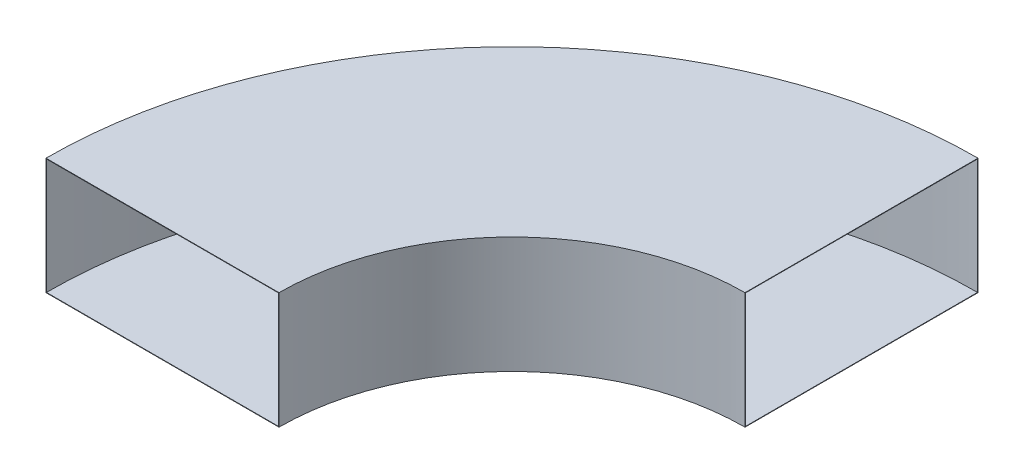
ISO-10303-21;
HEADER;
FILE_DESCRIPTION(('STEP AP214'),'2;1');
FILE_NAME('part.step','',(''),(''),'','','');
FILE_SCHEMA(('AUTOMOTIVE_DESIGN { 1 0 10303 214 1 1 1 1 }'));
ENDSEC;
DATA;
#1=APPLICATION_CONTEXT('core data for automotive mechanical design processes');
#2=APPLICATION_PROTOCOL_DEFINITION('international standard','automotive_design',2000,#1);
#3=PRODUCT_CONTEXT('',#1,'mechanical');
#4=PRODUCT('Part','Part','',(#3));
#5=PRODUCT_RELATED_PRODUCT_CATEGORY('part','',(#4));
#6=PRODUCT_DEFINITION_FORMATION('','',#4);
#7=PRODUCT_DEFINITION_CONTEXT('part definition',#1,'design');
#8=PRODUCT_DEFINITION('design','',#6,#7);
#9=PRODUCT_DEFINITION_SHAPE('','',#8);
#10=(LENGTH_UNIT() NAMED_UNIT(*) SI_UNIT(.MILLI.,.METRE.));
#11=(NAMED_UNIT(*) PLANE_ANGLE_UNIT() SI_UNIT($,.RADIAN.));
#12=(NAMED_UNIT(*) SI_UNIT($,.STERADIAN.) SOLID_ANGLE_UNIT());
#13=UNCERTAINTY_MEASURE_WITH_UNIT(LENGTH_MEASURE(1.E-05),#10,'distance_accuracy_value','');
#14=(GEOMETRIC_REPRESENTATION_CONTEXT(3) GLOBAL_UNCERTAINTY_ASSIGNED_CONTEXT((#13)) GLOBAL_UNIT_ASSIGNED_CONTEXT((#10,
#11,#12)) REPRESENTATION_CONTEXT('',''));
#15=CARTESIAN_POINT('',(0.,0.,0.));
#16=DIRECTION('',(0.,0.,1.));
#17=DIRECTION('',(1.,0.,0.));
#18=AXIS2_PLACEMENT_3D('',#15,#16,#17);
#19=CARTESIAN_POINT('',(0.,0.,0.));
#20=DIRECTION('',(0.,-1.,0.));
#21=DIRECTION('',(0.,0.,-1.));
#22=AXIS2_PLACEMENT_3D('',#19,#20,#21);
#23=CYLINDRICAL_SURFACE('',#22,1000.);
#24=CARTESIAN_POINT('',(0.,-250.000000000004,0.));
#25=DIRECTION('',(0.,-1.,0.));
#26=DIRECTION('',(0.,0.,-1.));
#27=AXIS2_PLACEMENT_3D('',#24,#25,#26);
#28=CIRCLE('',#27,1000.);
#29=CARTESIAN_POINT('',(-1000.,-250.000000000004,3.49148133884314E-12));
#30=VERTEX_POINT('',#29);
#31=CARTESIAN_POINT('',(0.,-250.000000000004,-1000.));
#32=VERTEX_POINT('',#31);
#33=EDGE_CURVE('E11',#30,#32,#28,.T.);
#34=ORIENTED_EDGE('',*,*,#33,.T.);
#35=DIRECTION('',(0.,-1.,0.));
#36=VECTOR('',#35,1.);
#37=CARTESIAN_POINT('',(0.,249.999999999996,-999.999999999998));
#38=LINE('',#37,#36);
#39=CARTESIAN_POINT('',(0.,249.999999999996,-999.999999999998));
#40=VERTEX_POINT('',#39);
#41=EDGE_CURVE('E107',#40,#32,#38,.T.);
#42=ORIENTED_EDGE('',*,*,#41,.F.);
#43=CARTESIAN_POINT('',(0.,249.999999999996,0.));
#44=DIRECTION('',(0.,-1.,0.));
#45=DIRECTION('',(0.,0.,-1.));
#46=AXIS2_PLACEMENT_3D('',#43,#44,#45);
#47=CIRCLE('',#46,999.999999999998);
#48=CARTESIAN_POINT('',(-999.999999999998,249.999999999996,3.49148133884313E-12));
#49=VERTEX_POINT('',#48);
#50=EDGE_CURVE('E156',#49,#40,#47,.T.);
#51=ORIENTED_EDGE('',*,*,#50,.F.);
#52=DIRECTION('',(0.,-1.,0.));
#53=VECTOR('',#52,1.);
#54=CARTESIAN_POINT('',(-999.999999999998,249.999999999996,3.49148133884313E-12));
#55=LINE('',#54,#53);
#56=EDGE_CURVE('E144',#49,#30,#55,.T.);
#57=ORIENTED_EDGE('',*,*,#56,.T.);
#58=EDGE_LOOP('',(#34,#42,#51,#57));
#59=FACE_BOUND('',#58,.T.);
#60=ADVANCED_FACE('F34',(#59),#23,.F.);
#61=CARTESIAN_POINT('',(-1000.,-250.,3.49148133884314E-12));
#62=DIRECTION('',(0.,-1.,0.));
#63=DIRECTION('',(0.,0.,-1.));
#64=AXIS2_PLACEMENT_3D('',#61,#62,#63);
#65=PLANE('',#64);
#66=CARTESIAN_POINT('',(0.,-249.999999999996,0.));
#67=DIRECTION('',(0.,-1.,0.));
#68=DIRECTION('',(0.,0.,-1.));
#69=AXIS2_PLACEMENT_3D('',#66,#67,#68);
#70=CIRCLE('',#69,2000.);
#71=CARTESIAN_POINT('',(-2000.,-249.999999999996,6.98296267768627E-12));
#72=VERTEX_POINT('',#71);
#73=CARTESIAN_POINT('',(0.,-249.999999999996,-2000.));
#74=VERTEX_POINT('',#73);
#75=EDGE_CURVE('E42',#72,#74,#70,.T.);
#76=ORIENTED_EDGE('',*,*,#75,.T.);
#77=DIRECTION('',(0.,0.,-1.));
#78=VECTOR('',#77,1.);
#79=CARTESIAN_POINT('',(0.,-250.000000000004,-1000.));
#80=LINE('',#79,#78);
#81=EDGE_CURVE('E135',#32,#74,#80,.T.);
#82=ORIENTED_EDGE('',*,*,#81,.F.);
#83=ORIENTED_EDGE('',*,*,#33,.F.);
#84=DIRECTION('',(-1.,0.,0.));
#85=VECTOR('',#84,1.);
#86=CARTESIAN_POINT('',(-1000.,-250.000000000004,3.49148133884314E-12));
#87=LINE('',#86,#85);
#88=EDGE_CURVE('E147',#30,#72,#87,.T.);
#89=ORIENTED_EDGE('',*,*,#88,.T.);
#90=EDGE_LOOP('',(#76,#82,#83,#89));
#91=FACE_BOUND('',#90,.T.);
#92=ADVANCED_FACE('F36',(#91),#65,.T.);
#93=CARTESIAN_POINT('',(0.,0.,0.));
#94=DIRECTION('',(0.,-1.,0.));
#95=DIRECTION('',(0.,0.,-1.));
#96=AXIS2_PLACEMENT_3D('',#93,#94,#95);
#97=CYLINDRICAL_SURFACE('',#96,2000.);
#98=CARTESIAN_POINT('',(0.,250.000000000004,0.));
#99=DIRECTION('',(0.,-1.,0.));
#100=DIRECTION('',(0.,0.,-1.));
#101=AXIS2_PLACEMENT_3D('',#98,#99,#100);
#102=CIRCLE('',#101,2000.);
#103=CARTESIAN_POINT('',(-2000.,250.000000000004,6.98296267768626E-12));
#104=VERTEX_POINT('',#103);
#105=CARTESIAN_POINT('',(0.,250.000000000004,-2000.));
#106=VERTEX_POINT('',#105);
#107=EDGE_CURVE('E158',#104,#106,#102,.T.);
#108=ORIENTED_EDGE('',*,*,#107,.T.);
#109=DIRECTION('',(0.,1.,0.));
#110=VECTOR('',#109,1.);
#111=CARTESIAN_POINT('',(0.,250.000000000004,-2000.));
#112=LINE('',#111,#110);
#113=EDGE_CURVE('E138',#74,#106,#112,.T.);
#114=ORIENTED_EDGE('',*,*,#113,.F.);
#115=ORIENTED_EDGE('',*,*,#75,.F.);
#116=DIRECTION('',(0.,1.,0.));
#117=VECTOR('',#116,1.);
#118=CARTESIAN_POINT('',(-2000.,250.000000000004,6.98296267768626E-12));
#119=LINE('',#118,#117);
#120=EDGE_CURVE('E150',#72,#104,#119,.T.);
#121=ORIENTED_EDGE('',*,*,#120,.T.);
#122=EDGE_LOOP('',(#108,#114,#115,#121));
#123=FACE_BOUND('',#122,.T.);
#124=ADVANCED_FACE('F167',(#123),#97,.T.);
#125=CARTESIAN_POINT('',(-999.999999999998,250.,3.49148133884313E-12));
#126=DIRECTION('',(0.,1.,0.));
#127=DIRECTION('',(0.,0.,1.));
#128=AXIS2_PLACEMENT_3D('',#125,#126,#127);
#129=PLANE('',#128);
#130=DIRECTION('',(1.,0.,0.));
#131=VECTOR('',#130,1.);
#132=CARTESIAN_POINT('',(-999.999999999998,249.999999999996,3.49148133884313E-12));
#133=LINE('',#132,#131);
#134=EDGE_CURVE('E153',#104,#49,#133,.T.);
#135=ORIENTED_EDGE('',*,*,#134,.T.);
#136=ORIENTED_EDGE('',*,*,#50,.T.);
#137=DIRECTION('',(0.,0.,1.));
#138=VECTOR('',#137,1.);
#139=CARTESIAN_POINT('',(0.,249.999999999996,-999.999999999998));
#140=LINE('',#139,#138);
#141=EDGE_CURVE('E141',#106,#40,#140,.T.);
#142=ORIENTED_EDGE('',*,*,#141,.F.);
#143=ORIENTED_EDGE('',*,*,#107,.F.);
#144=EDGE_LOOP('',(#135,#136,#142,#143));
#145=FACE_BOUND('',#144,.T.);
#146=ADVANCED_FACE('F170',(#145),#129,.T.);
#147=CARTESIAN_POINT('',(0.,0.,0.));
#148=DIRECTION('',(0.,0.,-1.));
#149=DIRECTION('',(-1.,0.,0.));
#150=AXIS2_PLACEMENT_3D('',#147,#148,#149);
#151=PLANE('',#150);
#152=DIRECTION('',(1.,0.,0.));
#153=VECTOR('',#152,1.);
#154=CARTESIAN_POINT('',(0.,248.,0.));
#155=LINE('',#154,#153);
#156=CARTESIAN_POINT('',(-1998.,248.,6.97597971500858E-12));
#157=VERTEX_POINT('',#156);
#158=CARTESIAN_POINT('',(-1002.,248.,3.49846430152082E-12));
#159=VERTEX_POINT('',#158);
#160=EDGE_CURVE('E128',#157,#159,#155,.T.);
#161=ORIENTED_EDGE('',*,*,#160,.T.);
#162=DIRECTION('',(0.,-1.,0.));
#163=VECTOR('',#162,1.);
#164=CARTESIAN_POINT('',(-1002.,248.,3.49846430152082E-12));
#165=LINE('',#164,#163);
#166=CARTESIAN_POINT('',(-1002.,-248.,3.49846430152082E-12));
#167=VERTEX_POINT('',#166);
#168=EDGE_CURVE('E126',#159,#167,#165,.T.);
#169=ORIENTED_EDGE('',*,*,#168,.T.);
#170=DIRECTION('',(-1.,0.,0.));
#171=VECTOR('',#170,1.);
#172=CARTESIAN_POINT('',(0.,-248.,0.));
#173=LINE('',#172,#171);
#174=CARTESIAN_POINT('',(-1998.,-248.,6.97597971500858E-12));
#175=VERTEX_POINT('',#174);
#176=EDGE_CURVE('E103',#167,#175,#173,.T.);
#177=ORIENTED_EDGE('',*,*,#176,.T.);
#178=DIRECTION('',(0.,-1.,0.));
#179=VECTOR('',#178,1.);
#180=CARTESIAN_POINT('',(-1998.,-248.,6.97597971500858E-12));
#181=LINE('',#180,#179);
#182=EDGE_CURVE('E49',#175,#157,#181,.F.);
#183=ORIENTED_EDGE('',*,*,#182,.T.);
#184=EDGE_LOOP('',(#161,#169,#177,#183));
#185=FACE_BOUND('',#184,.T.);
#186=ORIENTED_EDGE('',*,*,#56,.F.);
#187=ORIENTED_EDGE('',*,*,#134,.F.);
#188=ORIENTED_EDGE('',*,*,#120,.F.);
#189=ORIENTED_EDGE('',*,*,#88,.F.);
#190=EDGE_LOOP('',(#186,#187,#188,#189));
#191=FACE_BOUND('',#190,.T.);
#192=ADVANCED_FACE('F174',(#185,#191),#151,.F.);
#193=CARTESIAN_POINT('',(0.,0.,0.));
#194=DIRECTION('',(1.,0.,0.));
#195=DIRECTION('',(0.,0.,-1.));
#196=AXIS2_PLACEMENT_3D('',#193,#194,#195);
#197=PLANE('',#196);
#198=DIRECTION('',(0.,-1.,0.));
#199=VECTOR('',#198,1.);
#200=CARTESIAN_POINT('',(0.,248.,-1002.));
#201=LINE('',#200,#199);
#202=CARTESIAN_POINT('',(0.,248.,-1002.));
#203=VERTEX_POINT('',#202);
#204=CARTESIAN_POINT('',(0.,-248.,-1002.));
#205=VERTEX_POINT('',#204);
#206=EDGE_CURVE('E111',#203,#205,#201,.T.);
#207=ORIENTED_EDGE('',*,*,#206,.F.);
#208=DIRECTION('',(0.,0.,1.));
#209=VECTOR('',#208,1.);
#210=CARTESIAN_POINT('',(0.,248.,0.));
#211=LINE('',#210,#209);
#212=CARTESIAN_POINT('',(0.,248.,-1998.));
#213=VERTEX_POINT('',#212);
#214=EDGE_CURVE('E121',#213,#203,#211,.T.);
#215=ORIENTED_EDGE('',*,*,#214,.F.);
#216=DIRECTION('',(0.,-1.,0.));
#217=VECTOR('',#216,1.);
#218=CARTESIAN_POINT('',(0.,-248.,-1998.));
#219=LINE('',#218,#217);
#220=CARTESIAN_POINT('',(0.,-248.,-1998.));
#221=VERTEX_POINT('',#220);
#222=EDGE_CURVE('E54',#221,#213,#219,.F.);
#223=ORIENTED_EDGE('',*,*,#222,.F.);
#224=DIRECTION('',(0.,0.,-1.));
#225=VECTOR('',#224,1.);
#226=CARTESIAN_POINT('',(0.,-248.,0.));
#227=LINE('',#226,#225);
#228=EDGE_CURVE('E101',#205,#221,#227,.T.);
#229=ORIENTED_EDGE('',*,*,#228,.F.);
#230=EDGE_LOOP('',(#207,#215,#223,#229));
#231=FACE_BOUND('',#230,.T.);
#232=ORIENTED_EDGE('',*,*,#41,.T.);
#233=ORIENTED_EDGE('',*,*,#81,.T.);
#234=ORIENTED_EDGE('',*,*,#113,.T.);
#235=ORIENTED_EDGE('',*,*,#141,.T.);
#236=EDGE_LOOP('',(#232,#233,#234,#235));
#237=FACE_BOUND('',#236,.T.);
#238=ADVANCED_FACE('F118',(#231,#237),#197,.T.);
#239=CARTESIAN_POINT('',(0.,0.,0.));
#240=DIRECTION('',(0.,-1.,0.));
#241=DIRECTION('',(0.,0.,-1.));
#242=AXIS2_PLACEMENT_3D('',#239,#240,#241);
#243=CYLINDRICAL_SURFACE('',#242,1002.);
#244=CARTESIAN_POINT('',(0.,-248.,0.));
#245=DIRECTION('',(0.,-1.,0.));
#246=DIRECTION('',(0.,0.,-1.));
#247=AXIS2_PLACEMENT_3D('',#244,#245,#246);
#248=CIRCLE('',#247,1002.);
#249=EDGE_CURVE('E97',#167,#205,#248,.T.);
#250=ORIENTED_EDGE('',*,*,#249,.F.);
#251=ORIENTED_EDGE('',*,*,#168,.F.);
#252=CARTESIAN_POINT('',(0.,248.,0.));
#253=DIRECTION('',(0.,1.,0.));
#254=DIRECTION('',(0.,0.,1.));
#255=AXIS2_PLACEMENT_3D('',#252,#253,#254);
#256=CIRCLE('',#255,1002.);
#257=EDGE_CURVE('E113',#159,#203,#256,.F.);
#258=ORIENTED_EDGE('',*,*,#257,.T.);
#259=ORIENTED_EDGE('',*,*,#206,.T.);
#260=EDGE_LOOP('',(#250,#251,#258,#259));
#261=FACE_BOUND('',#260,.T.);
#262=ADVANCED_FACE('F112',(#261),#243,.T.);
#263=CARTESIAN_POINT('',(-1000.,-248.,3.49148133884314E-12));
#264=DIRECTION('',(0.,-1.,0.));
#265=DIRECTION('',(0.,0.,-1.));
#266=AXIS2_PLACEMENT_3D('',#263,#264,#265);
#267=PLANE('',#266);
#268=CARTESIAN_POINT('',(0.,-248.,0.));
#269=DIRECTION('',(0.,-1.,0.));
#270=DIRECTION('',(0.,0.,-1.));
#271=AXIS2_PLACEMENT_3D('',#268,#269,#270);
#272=CIRCLE('',#271,1998.);
#273=EDGE_CURVE('E108',#175,#221,#272,.T.);
#274=ORIENTED_EDGE('',*,*,#273,.F.);
#275=ORIENTED_EDGE('',*,*,#176,.F.);
#276=ORIENTED_EDGE('',*,*,#249,.T.);
#277=ORIENTED_EDGE('',*,*,#228,.T.);
#278=EDGE_LOOP('',(#274,#275,#276,#277));
#279=FACE_BOUND('',#278,.T.);
#280=ADVANCED_FACE('F99',(#279),#267,.F.);
#281=CARTESIAN_POINT('',(0.,0.,0.));
#282=DIRECTION('',(0.,-1.,0.));
#283=DIRECTION('',(0.,0.,-1.));
#284=AXIS2_PLACEMENT_3D('',#281,#282,#283);
#285=CYLINDRICAL_SURFACE('',#284,1998.);
#286=CARTESIAN_POINT('',(0.,248.,0.));
#287=DIRECTION('',(0.,1.,0.));
#288=DIRECTION('',(0.,0.,1.));
#289=AXIS2_PLACEMENT_3D('',#286,#287,#288);
#290=CIRCLE('',#289,1998.);
#291=EDGE_CURVE('E248',#157,#213,#290,.F.);
#292=ORIENTED_EDGE('',*,*,#291,.F.);
#293=ORIENTED_EDGE('',*,*,#182,.F.);
#294=ORIENTED_EDGE('',*,*,#273,.T.);
#295=ORIENTED_EDGE('',*,*,#222,.T.);
#296=EDGE_LOOP('',(#292,#293,#294,#295));
#297=FACE_BOUND('',#296,.T.);
#298=ADVANCED_FACE('F225',(#297),#285,.F.);
#299=CARTESIAN_POINT('',(-999.999999999998,248.,3.49148133884313E-12));
#300=DIRECTION('',(0.,1.,0.));
#301=DIRECTION('',(0.,0.,1.));
#302=AXIS2_PLACEMENT_3D('',#299,#300,#301);
#303=PLANE('',#302);
#304=ORIENTED_EDGE('',*,*,#160,.F.);
#305=ORIENTED_EDGE('',*,*,#291,.T.);
#306=ORIENTED_EDGE('',*,*,#214,.T.);
#307=ORIENTED_EDGE('',*,*,#257,.F.);
#308=EDGE_LOOP('',(#304,#305,#306,#307));
#309=FACE_BOUND('',#308,.T.);
#310=ADVANCED_FACE('F234',(#309),#303,.F.);
#311=CLOSED_SHELL('',(#60,#92,#124,#146,#192,#238,#262,#280,#298,#310));
#312=MANIFOLD_SOLID_BREP('B2',#311);
#313=ADVANCED_BREP_SHAPE_REPRESENTATION('',(#18,#312),#14);
#314=SHAPE_DEFINITION_REPRESENTATION(#9,#313);
ENDSEC;
END-ISO-10303-21;
